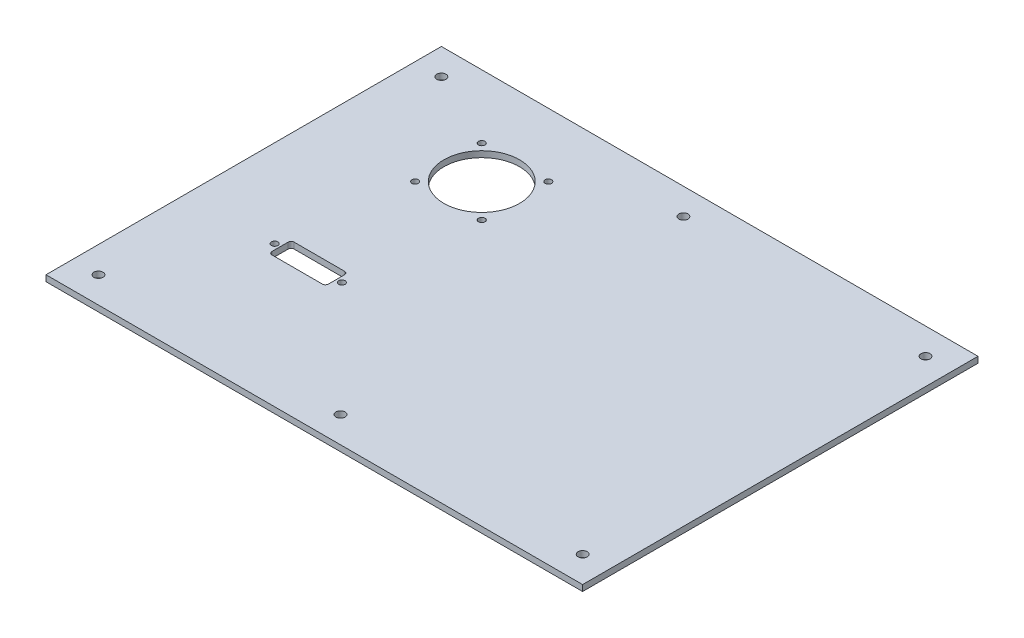
ISO-10303-21;
HEADER;
FILE_DESCRIPTION(('STEP AP214'),'2;1');
FILE_NAME('part.step','',(''),(''),'','','');
FILE_SCHEMA(('AUTOMOTIVE_DESIGN { 1 0 10303 214 1 1 1 1 }'));
ENDSEC;
DATA;
#1=APPLICATION_CONTEXT('core data for automotive mechanical design processes');
#2=APPLICATION_PROTOCOL_DEFINITION('international standard','automotive_design',2000,#1);
#3=PRODUCT_CONTEXT('',#1,'mechanical');
#4=PRODUCT('Part','Part','',(#3));
#5=PRODUCT_RELATED_PRODUCT_CATEGORY('part','',(#4));
#6=PRODUCT_DEFINITION_FORMATION('','',#4);
#7=PRODUCT_DEFINITION_CONTEXT('part definition',#1,'design');
#8=PRODUCT_DEFINITION('design','',#6,#7);
#9=PRODUCT_DEFINITION_SHAPE('','',#8);
#10=(LENGTH_UNIT() NAMED_UNIT(*) SI_UNIT(.MILLI.,.METRE.));
#11=(NAMED_UNIT(*) PLANE_ANGLE_UNIT() SI_UNIT($,.RADIAN.));
#12=(NAMED_UNIT(*) SI_UNIT($,.STERADIAN.) SOLID_ANGLE_UNIT());
#13=UNCERTAINTY_MEASURE_WITH_UNIT(LENGTH_MEASURE(1.E-05),#10,'distance_accuracy_value','');
#14=(GEOMETRIC_REPRESENTATION_CONTEXT(3) GLOBAL_UNCERTAINTY_ASSIGNED_CONTEXT((#13)) GLOBAL_UNIT_ASSIGNED_CONTEXT((#10,
#11,#12)) REPRESENTATION_CONTEXT('',''));
#15=CARTESIAN_POINT('',(0.,0.,0.));
#16=DIRECTION('',(0.,0.,1.));
#17=DIRECTION('',(1.,0.,0.));
#18=AXIS2_PLACEMENT_3D('',#15,#16,#17);
#19=CARTESIAN_POINT('',(0.,3.,0.));
#20=DIRECTION('',(0.,-1.,0.));
#21=DIRECTION('',(0.,0.,-1.));
#22=AXIS2_PLACEMENT_3D('',#19,#20,#21);
#23=PLANE('',#22);
#24=CARTESIAN_POINT('',(76.66,3.,-70.));
#25=DIRECTION('',(0.,1.,0.));
#26=DIRECTION('',(0.,0.,1.));
#27=AXIS2_PLACEMENT_3D('',#24,#25,#26);
#28=CIRCLE('',#27,1.60000000000001);
#29=CARTESIAN_POINT('',(76.66,3.,-68.4));
#30=VERTEX_POINT('',#29);
#31=EDGE_CURVE('E402',#30,#30,#28,.T.);
#32=ORIENTED_EDGE('',*,*,#31,.F.);
#33=EDGE_LOOP('',(#32));
#34=FACE_BOUND('',#33,.T.);
#35=CARTESIAN_POINT('',(43.34,3.,-70.));
#36=DIRECTION('',(0.,1.,0.));
#37=DIRECTION('',(0.,0.,1.));
#38=AXIS2_PLACEMENT_3D('',#35,#36,#37);
#39=CIRCLE('',#38,1.6);
#40=CARTESIAN_POINT('',(43.34,3.,-68.4));
#41=VERTEX_POINT('',#40);
#42=EDGE_CURVE('E404',#41,#41,#39,.T.);
#43=ORIENTED_EDGE('',*,*,#42,.F.);
#44=EDGE_LOOP('',(#43));
#45=FACE_BOUND('',#44,.T.);
#46=DIRECTION('',(0.,0.,1.));
#47=VECTOR('',#46,1.);
#48=CARTESIAN_POINT('',(46.,3.,-75.5));
#49=LINE('',#48,#47);
#50=CARTESIAN_POINT('',(46.,3.,-74.));
#51=VERTEX_POINT('',#50);
#52=CARTESIAN_POINT('',(46.,3.,-66.));
#53=VERTEX_POINT('',#52);
#54=EDGE_CURVE('E191',#51,#53,#49,.T.);
#55=ORIENTED_EDGE('',*,*,#54,.F.);
#56=CARTESIAN_POINT('',(47.5,3.,-74.));
#57=DIRECTION('',(0.,-1.,0.));
#58=DIRECTION('',(0.,0.,-1.));
#59=AXIS2_PLACEMENT_3D('',#56,#57,#58);
#60=CIRCLE('',#59,1.5);
#61=CARTESIAN_POINT('',(47.5,3.,-75.5));
#62=VERTEX_POINT('',#61);
#63=EDGE_CURVE('E44',#51,#62,#60,.T.);
#64=ORIENTED_EDGE('',*,*,#63,.T.);
#65=DIRECTION('',(-1.,0.,0.));
#66=VECTOR('',#65,1.);
#67=CARTESIAN_POINT('',(46.,3.,-75.5));
#68=LINE('',#67,#66);
#69=CARTESIAN_POINT('',(72.5,3.,-75.5));
#70=VERTEX_POINT('',#69);
#71=EDGE_CURVE('E190',#70,#62,#68,.T.);
#72=ORIENTED_EDGE('',*,*,#71,.F.);
#73=CARTESIAN_POINT('',(72.5,3.,-74.));
#74=DIRECTION('',(0.,-1.,0.));
#75=DIRECTION('',(0.,0.,-1.));
#76=AXIS2_PLACEMENT_3D('',#73,#74,#75);
#77=CIRCLE('',#76,1.5);
#78=CARTESIAN_POINT('',(74.,3.,-74.));
#79=VERTEX_POINT('',#78);
#80=EDGE_CURVE('E178',#70,#79,#77,.T.);
#81=ORIENTED_EDGE('',*,*,#80,.T.);
#82=DIRECTION('',(0.,0.,-1.));
#83=VECTOR('',#82,1.);
#84=CARTESIAN_POINT('',(74.,3.,-75.5));
#85=LINE('',#84,#83);
#86=CARTESIAN_POINT('',(74.,3.,-66.));
#87=VERTEX_POINT('',#86);
#88=EDGE_CURVE('E210',#87,#79,#85,.T.);
#89=ORIENTED_EDGE('',*,*,#88,.F.);
#90=CARTESIAN_POINT('',(72.5,3.,-66.));
#91=DIRECTION('',(0.,-1.,0.));
#92=DIRECTION('',(0.,0.,-1.));
#93=AXIS2_PLACEMENT_3D('',#90,#91,#92);
#94=CIRCLE('',#93,1.5);
#95=CARTESIAN_POINT('',(72.5,3.,-64.5));
#96=VERTEX_POINT('',#95);
#97=EDGE_CURVE('E174',#87,#96,#94,.T.);
#98=ORIENTED_EDGE('',*,*,#97,.T.);
#99=DIRECTION('',(1.,0.,0.));
#100=VECTOR('',#99,1.);
#101=CARTESIAN_POINT('',(46.,3.,-64.5));
#102=LINE('',#101,#100);
#103=CARTESIAN_POINT('',(47.5,3.,-64.5));
#104=VERTEX_POINT('',#103);
#105=EDGE_CURVE('E218',#104,#96,#102,.T.);
#106=ORIENTED_EDGE('',*,*,#105,.F.);
#107=CARTESIAN_POINT('',(47.5,3.,-66.));
#108=DIRECTION('',(0.,-1.,0.));
#109=DIRECTION('',(0.,0.,-1.));
#110=AXIS2_PLACEMENT_3D('',#107,#108,#109);
#111=CIRCLE('',#110,1.5);
#112=EDGE_CURVE('E182',#104,#53,#111,.T.);
#113=ORIENTED_EDGE('',*,*,#112,.T.);
#114=EDGE_LOOP('',(#55,#64,#72,#81,#89,#98,#106,#113));
#115=FACE_BOUND('',#114,.T.);
#116=CARTESIAN_POINT('',(51.4999999999993,3.,-164.5));
#117=DIRECTION('',(0.,1.,0.));
#118=DIRECTION('',(0.,0.,1.));
#119=AXIS2_PLACEMENT_3D('',#116,#117,#118);
#120=CIRCLE('',#119,1.6);
#121=CARTESIAN_POINT('',(51.4999999999993,3.,-162.9));
#122=VERTEX_POINT('',#121);
#123=EDGE_CURVE('E215',#122,#122,#120,.T.);
#124=ORIENTED_EDGE('',*,*,#123,.F.);
#125=EDGE_LOOP('',(#124));
#126=FACE_BOUND('',#125,.T.);
#127=CARTESIAN_POINT('',(51.4999999999993,3.,-131.5));
#128=DIRECTION('',(0.,1.,0.));
#129=DIRECTION('',(0.,0.,1.));
#130=AXIS2_PLACEMENT_3D('',#127,#128,#129);
#131=CIRCLE('',#130,1.6);
#132=CARTESIAN_POINT('',(51.4999999999993,3.,-129.9));
#133=VERTEX_POINT('',#132);
#134=EDGE_CURVE('E226',#133,#133,#131,.T.);
#135=ORIENTED_EDGE('',*,*,#134,.F.);
#136=EDGE_LOOP('',(#135));
#137=FACE_BOUND('',#136,.T.);
#138=CARTESIAN_POINT('',(84.4999999999993,3.,-131.5));
#139=DIRECTION('',(0.,1.,0.));
#140=DIRECTION('',(0.,0.,1.));
#141=AXIS2_PLACEMENT_3D('',#138,#139,#140);
#142=CIRCLE('',#141,1.6);
#143=CARTESIAN_POINT('',(84.4999999999993,3.,-129.9));
#144=VERTEX_POINT('',#143);
#145=EDGE_CURVE('E232',#144,#144,#142,.T.);
#146=ORIENTED_EDGE('',*,*,#145,.F.);
#147=EDGE_LOOP('',(#146));
#148=FACE_BOUND('',#147,.T.);
#149=CARTESIAN_POINT('',(84.4999999999993,3.,-164.5));
#150=DIRECTION('',(0.,1.,0.));
#151=DIRECTION('',(0.,0.,1.));
#152=AXIS2_PLACEMENT_3D('',#149,#150,#151);
#153=CIRCLE('',#152,1.6);
#154=CARTESIAN_POINT('',(84.4999999999993,3.,-162.9));
#155=VERTEX_POINT('',#154);
#156=EDGE_CURVE('E238',#155,#155,#153,.T.);
#157=ORIENTED_EDGE('',*,*,#156,.F.);
#158=EDGE_LOOP('',(#157));
#159=FACE_BOUND('',#158,.T.);
#160=CARTESIAN_POINT('',(67.9999999999993,3.,-148.));
#161=DIRECTION('',(0.,1.,0.));
#162=DIRECTION('',(0.,0.,1.));
#163=AXIS2_PLACEMENT_3D('',#160,#161,#162);
#164=CIRCLE('',#163,18.75);
#165=CARTESIAN_POINT('',(67.9999999999993,3.,-129.25));
#166=VERTEX_POINT('',#165);
#167=EDGE_CURVE('E244',#166,#166,#164,.T.);
#168=ORIENTED_EDGE('',*,*,#167,.F.);
#169=EDGE_LOOP('',(#168));
#170=FACE_BOUND('',#169,.T.);
#171=DIRECTION('',(0.,0.,1.));
#172=VECTOR('',#171,1.);
#173=CARTESIAN_POINT('',(0.,3.,0.));
#174=LINE('',#173,#172);
#175=CARTESIAN_POINT('',(0.,3.,-196.));
#176=VERTEX_POINT('',#175);
#177=CARTESIAN_POINT('',(0.,3.,0.));
#178=VERTEX_POINT('',#177);
#179=EDGE_CURVE('E136',#176,#178,#174,.T.);
#180=ORIENTED_EDGE('',*,*,#179,.T.);
#181=DIRECTION('',(1.,0.,0.));
#182=VECTOR('',#181,1.);
#183=CARTESIAN_POINT('',(0.,3.,0.));
#184=LINE('',#183,#182);
#185=CARTESIAN_POINT('',(266.,3.,0.));
#186=VERTEX_POINT('',#185);
#187=EDGE_CURVE('E125',#178,#186,#184,.T.);
#188=ORIENTED_EDGE('',*,*,#187,.T.);
#189=DIRECTION('',(0.,0.,-1.));
#190=VECTOR('',#189,1.);
#191=CARTESIAN_POINT('',(266.,3.,0.));
#192=LINE('',#191,#190);
#193=CARTESIAN_POINT('',(266.,3.,-196.));
#194=VERTEX_POINT('',#193);
#195=EDGE_CURVE('E135',#186,#194,#192,.T.);
#196=ORIENTED_EDGE('',*,*,#195,.T.);
#197=DIRECTION('',(-1.,0.,0.));
#198=VECTOR('',#197,1.);
#199=CARTESIAN_POINT('',(0.,3.,-196.));
#200=LINE('',#199,#198);
#201=EDGE_CURVE('E141',#194,#176,#200,.T.);
#202=ORIENTED_EDGE('',*,*,#201,.T.);
#203=EDGE_LOOP('',(#180,#188,#196,#202));
#204=FACE_BOUND('',#203,.T.);
#205=CARTESIAN_POINT('',(13.,3.,-183.));
#206=DIRECTION('',(0.,1.,0.));
#207=DIRECTION('',(0.,0.,1.));
#208=AXIS2_PLACEMENT_3D('',#205,#206,#207);
#209=CIRCLE('',#208,2.25);
#210=CARTESIAN_POINT('',(13.,3.,-180.75));
#211=VERTEX_POINT('',#210);
#212=EDGE_CURVE('E283',#211,#211,#209,.T.);
#213=ORIENTED_EDGE('',*,*,#212,.F.);
#214=EDGE_LOOP('',(#213));
#215=FACE_BOUND('',#214,.T.);
#216=CARTESIAN_POINT('',(253.,3.,-183.));
#217=DIRECTION('',(0.,1.,0.));
#218=DIRECTION('',(0.,0.,1.));
#219=AXIS2_PLACEMENT_3D('',#216,#217,#218);
#220=CIRCLE('',#219,2.24999999999996);
#221=CARTESIAN_POINT('',(253.,3.,-180.75));
#222=VERTEX_POINT('',#221);
#223=EDGE_CURVE('E277',#222,#222,#220,.T.);
#224=ORIENTED_EDGE('',*,*,#223,.F.);
#225=EDGE_LOOP('',(#224));
#226=FACE_BOUND('',#225,.T.);
#227=CARTESIAN_POINT('',(253.,3.,-13.));
#228=DIRECTION('',(0.,1.,0.));
#229=DIRECTION('',(0.,0.,1.));
#230=AXIS2_PLACEMENT_3D('',#227,#228,#229);
#231=CIRCLE('',#230,2.24999999999995);
#232=CARTESIAN_POINT('',(253.,3.,-10.7500000000001));
#233=VERTEX_POINT('',#232);
#234=EDGE_CURVE('E271',#233,#233,#231,.T.);
#235=ORIENTED_EDGE('',*,*,#234,.F.);
#236=EDGE_LOOP('',(#235));
#237=FACE_BOUND('',#236,.T.);
#238=CARTESIAN_POINT('',(13.,3.,-13.));
#239=DIRECTION('',(0.,1.,0.));
#240=DIRECTION('',(0.,0.,1.));
#241=AXIS2_PLACEMENT_3D('',#238,#239,#240);
#242=CIRCLE('',#241,2.25);
#243=CARTESIAN_POINT('',(13.,3.,-10.75));
#244=VERTEX_POINT('',#243);
#245=EDGE_CURVE('E265',#244,#244,#242,.T.);
#246=ORIENTED_EDGE('',*,*,#245,.F.);
#247=EDGE_LOOP('',(#246));
#248=FACE_BOUND('',#247,.T.);
#249=CARTESIAN_POINT('',(133.,3.,-13.));
#250=DIRECTION('',(0.,1.,0.));
#251=DIRECTION('',(0.,0.,1.));
#252=AXIS2_PLACEMENT_3D('',#249,#250,#251);
#253=CIRCLE('',#252,2.25000000000004);
#254=CARTESIAN_POINT('',(133.,3.,-10.75));
#255=VERTEX_POINT('',#254);
#256=EDGE_CURVE('E259',#255,#255,#253,.T.);
#257=ORIENTED_EDGE('',*,*,#256,.F.);
#258=EDGE_LOOP('',(#257));
#259=FACE_BOUND('',#258,.T.);
#260=CARTESIAN_POINT('',(133.,3.,-183.));
#261=DIRECTION('',(0.,1.,0.));
#262=DIRECTION('',(0.,0.,1.));
#263=AXIS2_PLACEMENT_3D('',#260,#261,#262);
#264=CIRCLE('',#263,2.25000000000001);
#265=CARTESIAN_POINT('',(133.,3.,-180.75));
#266=VERTEX_POINT('',#265);
#267=EDGE_CURVE('E253',#266,#266,#264,.T.);
#268=ORIENTED_EDGE('',*,*,#267,.F.);
#269=EDGE_LOOP('',(#268));
#270=FACE_BOUND('',#269,.T.);
#271=ADVANCED_FACE('F36',(#34,#45,#115,#126,#137,#148,#159,#170,#204,#215,#226,#237,#248,#259,
#270),#23,.F.);
#272=CARTESIAN_POINT('',(0.,0.,0.));
#273=DIRECTION('',(0.,-1.,0.));
#274=DIRECTION('',(0.,0.,-1.));
#275=AXIS2_PLACEMENT_3D('',#272,#273,#274);
#276=PLANE('',#275);
#277=CARTESIAN_POINT('',(76.66,0.,-70.));
#278=DIRECTION('',(0.,1.,0.));
#279=DIRECTION('',(0.,0.,1.));
#280=AXIS2_PLACEMENT_3D('',#277,#278,#279);
#281=CIRCLE('',#280,1.60000000000001);
#282=CARTESIAN_POINT('',(76.66,0.,-68.4));
#283=VERTEX_POINT('',#282);
#284=EDGE_CURVE('E400',#283,#283,#281,.T.);
#285=ORIENTED_EDGE('',*,*,#284,.T.);
#286=EDGE_LOOP('',(#285));
#287=FACE_BOUND('',#286,.T.);
#288=CARTESIAN_POINT('',(43.34,0.,-70.));
#289=DIRECTION('',(0.,1.,0.));
#290=DIRECTION('',(0.,0.,1.));
#291=AXIS2_PLACEMENT_3D('',#288,#289,#290);
#292=CIRCLE('',#291,1.6);
#293=CARTESIAN_POINT('',(43.34,0.,-68.4));
#294=VERTEX_POINT('',#293);
#295=EDGE_CURVE('E199',#294,#294,#292,.T.);
#296=ORIENTED_EDGE('',*,*,#295,.T.);
#297=EDGE_LOOP('',(#296));
#298=FACE_BOUND('',#297,.T.);
#299=DIRECTION('',(0.,0.,-1.));
#300=VECTOR('',#299,1.);
#301=CARTESIAN_POINT('',(74.,0.,-75.5));
#302=LINE('',#301,#300);
#303=CARTESIAN_POINT('',(74.,0.,-66.));
#304=VERTEX_POINT('',#303);
#305=CARTESIAN_POINT('',(74.,0.,-74.));
#306=VERTEX_POINT('',#305);
#307=EDGE_CURVE('E208',#304,#306,#302,.T.);
#308=ORIENTED_EDGE('',*,*,#307,.T.);
#309=CARTESIAN_POINT('',(72.5,0.,-74.));
#310=DIRECTION('',(0.,-1.,0.));
#311=DIRECTION('',(0.,0.,-1.));
#312=AXIS2_PLACEMENT_3D('',#309,#310,#311);
#313=CIRCLE('',#312,1.5);
#314=CARTESIAN_POINT('',(72.5,0.,-75.5));
#315=VERTEX_POINT('',#314);
#316=EDGE_CURVE('E180',#306,#315,#313,.F.);
#317=ORIENTED_EDGE('',*,*,#316,.T.);
#318=DIRECTION('',(-1.,0.,0.));
#319=VECTOR('',#318,1.);
#320=CARTESIAN_POINT('',(46.,0.,-75.5));
#321=LINE('',#320,#319);
#322=CARTESIAN_POINT('',(47.5,0.,-75.5));
#323=VERTEX_POINT('',#322);
#324=EDGE_CURVE('E205',#315,#323,#321,.T.);
#325=ORIENTED_EDGE('',*,*,#324,.T.);
#326=CARTESIAN_POINT('',(47.5,0.,-74.));
#327=DIRECTION('',(0.,-1.,0.));
#328=DIRECTION('',(0.,0.,-1.));
#329=AXIS2_PLACEMENT_3D('',#326,#327,#328);
#330=CIRCLE('',#329,1.5);
#331=CARTESIAN_POINT('',(46.,0.,-74.));
#332=VERTEX_POINT('',#331);
#333=EDGE_CURVE('E11',#323,#332,#330,.F.);
#334=ORIENTED_EDGE('',*,*,#333,.T.);
#335=DIRECTION('',(0.,0.,1.));
#336=VECTOR('',#335,1.);
#337=CARTESIAN_POINT('',(46.,0.,-75.5));
#338=LINE('',#337,#336);
#339=CARTESIAN_POINT('',(46.,0.,-66.));
#340=VERTEX_POINT('',#339);
#341=EDGE_CURVE('E202',#332,#340,#338,.T.);
#342=ORIENTED_EDGE('',*,*,#341,.T.);
#343=CARTESIAN_POINT('',(47.5,0.,-66.));
#344=DIRECTION('',(0.,-1.,0.));
#345=DIRECTION('',(0.,0.,-1.));
#346=AXIS2_PLACEMENT_3D('',#343,#344,#345);
#347=CIRCLE('',#346,1.5);
#348=CARTESIAN_POINT('',(47.5,0.,-64.5));
#349=VERTEX_POINT('',#348);
#350=EDGE_CURVE('E184',#340,#349,#347,.F.);
#351=ORIENTED_EDGE('',*,*,#350,.T.);
#352=DIRECTION('',(1.,0.,0.));
#353=VECTOR('',#352,1.);
#354=CARTESIAN_POINT('',(46.,0.,-64.5));
#355=LINE('',#354,#353);
#356=CARTESIAN_POINT('',(72.5,0.,-64.5));
#357=VERTEX_POINT('',#356);
#358=EDGE_CURVE('E204',#349,#357,#355,.T.);
#359=ORIENTED_EDGE('',*,*,#358,.T.);
#360=CARTESIAN_POINT('',(72.5,0.,-66.));
#361=DIRECTION('',(0.,-1.,0.));
#362=DIRECTION('',(0.,0.,-1.));
#363=AXIS2_PLACEMENT_3D('',#360,#361,#362);
#364=CIRCLE('',#363,1.5);
#365=EDGE_CURVE('E176',#357,#304,#364,.F.);
#366=ORIENTED_EDGE('',*,*,#365,.T.);
#367=EDGE_LOOP('',(#308,#317,#325,#334,#342,#351,#359,#366));
#368=FACE_BOUND('',#367,.T.);
#369=CARTESIAN_POINT('',(51.4999999999993,0.,-164.5));
#370=DIRECTION('',(0.,1.,0.));
#371=DIRECTION('',(0.,0.,1.));
#372=AXIS2_PLACEMENT_3D('',#369,#370,#371);
#373=CIRCLE('',#372,1.6);
#374=CARTESIAN_POINT('',(51.4999999999993,0.,-162.9));
#375=VERTEX_POINT('',#374);
#376=EDGE_CURVE('E223',#375,#375,#373,.T.);
#377=ORIENTED_EDGE('',*,*,#376,.T.);
#378=EDGE_LOOP('',(#377));
#379=FACE_BOUND('',#378,.T.);
#380=CARTESIAN_POINT('',(51.4999999999993,0.,-131.5));
#381=DIRECTION('',(0.,1.,0.));
#382=DIRECTION('',(0.,0.,1.));
#383=AXIS2_PLACEMENT_3D('',#380,#381,#382);
#384=CIRCLE('',#383,1.6);
#385=CARTESIAN_POINT('',(51.4999999999993,0.,-129.9));
#386=VERTEX_POINT('',#385);
#387=EDGE_CURVE('E229',#386,#386,#384,.T.);
#388=ORIENTED_EDGE('',*,*,#387,.T.);
#389=EDGE_LOOP('',(#388));
#390=FACE_BOUND('',#389,.T.);
#391=CARTESIAN_POINT('',(84.4999999999993,0.,-131.5));
#392=DIRECTION('',(0.,1.,0.));
#393=DIRECTION('',(0.,0.,1.));
#394=AXIS2_PLACEMENT_3D('',#391,#392,#393);
#395=CIRCLE('',#394,1.6);
#396=CARTESIAN_POINT('',(84.4999999999993,0.,-129.9));
#397=VERTEX_POINT('',#396);
#398=EDGE_CURVE('E235',#397,#397,#395,.T.);
#399=ORIENTED_EDGE('',*,*,#398,.T.);
#400=EDGE_LOOP('',(#399));
#401=FACE_BOUND('',#400,.T.);
#402=CARTESIAN_POINT('',(84.4999999999993,0.,-164.5));
#403=DIRECTION('',(0.,1.,0.));
#404=DIRECTION('',(0.,0.,1.));
#405=AXIS2_PLACEMENT_3D('',#402,#403,#404);
#406=CIRCLE('',#405,1.6);
#407=CARTESIAN_POINT('',(84.4999999999993,0.,-162.9));
#408=VERTEX_POINT('',#407);
#409=EDGE_CURVE('E241',#408,#408,#406,.T.);
#410=ORIENTED_EDGE('',*,*,#409,.T.);
#411=EDGE_LOOP('',(#410));
#412=FACE_BOUND('',#411,.T.);
#413=CARTESIAN_POINT('',(67.9999999999993,0.,-148.));
#414=DIRECTION('',(0.,1.,0.));
#415=DIRECTION('',(0.,0.,1.));
#416=AXIS2_PLACEMENT_3D('',#413,#414,#415);
#417=CIRCLE('',#416,18.75);
#418=CARTESIAN_POINT('',(67.9999999999993,0.,-129.25));
#419=VERTEX_POINT('',#418);
#420=EDGE_CURVE('E247',#419,#419,#417,.T.);
#421=ORIENTED_EDGE('',*,*,#420,.T.);
#422=EDGE_LOOP('',(#421));
#423=FACE_BOUND('',#422,.T.);
#424=CARTESIAN_POINT('',(133.,0.,-13.));
#425=DIRECTION('',(0.,1.,0.));
#426=DIRECTION('',(0.,0.,1.));
#427=AXIS2_PLACEMENT_3D('',#424,#425,#426);
#428=CIRCLE('',#427,2.25000000000004);
#429=CARTESIAN_POINT('',(133.,0.,-10.75));
#430=VERTEX_POINT('',#429);
#431=EDGE_CURVE('E256',#430,#430,#428,.T.);
#432=ORIENTED_EDGE('',*,*,#431,.T.);
#433=EDGE_LOOP('',(#432));
#434=FACE_BOUND('',#433,.T.);
#435=CARTESIAN_POINT('',(253.,0.,-13.));
#436=DIRECTION('',(0.,1.,0.));
#437=DIRECTION('',(0.,0.,1.));
#438=AXIS2_PLACEMENT_3D('',#435,#436,#437);
#439=CIRCLE('',#438,2.24999999999995);
#440=CARTESIAN_POINT('',(253.,0.,-10.7500000000001));
#441=VERTEX_POINT('',#440);
#442=EDGE_CURVE('E268',#441,#441,#439,.T.);
#443=ORIENTED_EDGE('',*,*,#442,.T.);
#444=EDGE_LOOP('',(#443));
#445=FACE_BOUND('',#444,.T.);
#446=CARTESIAN_POINT('',(13.,0.,-183.));
#447=DIRECTION('',(0.,1.,0.));
#448=DIRECTION('',(0.,0.,1.));
#449=AXIS2_PLACEMENT_3D('',#446,#447,#448);
#450=CIRCLE('',#449,2.25);
#451=CARTESIAN_POINT('',(13.,0.,-180.75));
#452=VERTEX_POINT('',#451);
#453=EDGE_CURVE('E280',#452,#452,#450,.T.);
#454=ORIENTED_EDGE('',*,*,#453,.T.);
#455=EDGE_LOOP('',(#454));
#456=FACE_BOUND('',#455,.T.);
#457=DIRECTION('',(0.,0.,1.));
#458=VECTOR('',#457,1.);
#459=CARTESIAN_POINT('',(0.,0.,0.));
#460=LINE('',#459,#458);
#461=CARTESIAN_POINT('',(0.,0.,-196.));
#462=VERTEX_POINT('',#461);
#463=CARTESIAN_POINT('',(0.,0.,0.));
#464=VERTEX_POINT('',#463);
#465=EDGE_CURVE('E149',#462,#464,#460,.T.);
#466=ORIENTED_EDGE('',*,*,#465,.F.);
#467=DIRECTION('',(-1.,0.,0.));
#468=VECTOR('',#467,1.);
#469=CARTESIAN_POINT('',(0.,0.,-196.));
#470=LINE('',#469,#468);
#471=CARTESIAN_POINT('',(266.,0.,-196.));
#472=VERTEX_POINT('',#471);
#473=EDGE_CURVE('E145',#472,#462,#470,.T.);
#474=ORIENTED_EDGE('',*,*,#473,.F.);
#475=DIRECTION('',(0.,0.,-1.));
#476=VECTOR('',#475,1.);
#477=CARTESIAN_POINT('',(266.,0.,0.));
#478=LINE('',#477,#476);
#479=CARTESIAN_POINT('',(266.,0.,0.));
#480=VERTEX_POINT('',#479);
#481=EDGE_CURVE('E294',#480,#472,#478,.T.);
#482=ORIENTED_EDGE('',*,*,#481,.F.);
#483=DIRECTION('',(1.,0.,0.));
#484=VECTOR('',#483,1.);
#485=CARTESIAN_POINT('',(0.,0.,0.));
#486=LINE('',#485,#484);
#487=EDGE_CURVE('E292',#464,#480,#486,.T.);
#488=ORIENTED_EDGE('',*,*,#487,.F.);
#489=EDGE_LOOP('',(#466,#474,#482,#488));
#490=FACE_BOUND('',#489,.T.);
#491=CARTESIAN_POINT('',(253.,0.,-183.));
#492=DIRECTION('',(0.,1.,0.));
#493=DIRECTION('',(0.,0.,1.));
#494=AXIS2_PLACEMENT_3D('',#491,#492,#493);
#495=CIRCLE('',#494,2.24999999999996);
#496=CARTESIAN_POINT('',(253.,0.,-180.75));
#497=VERTEX_POINT('',#496);
#498=EDGE_CURVE('E274',#497,#497,#495,.T.);
#499=ORIENTED_EDGE('',*,*,#498,.T.);
#500=EDGE_LOOP('',(#499));
#501=FACE_BOUND('',#500,.T.);
#502=CARTESIAN_POINT('',(13.,0.,-13.));
#503=DIRECTION('',(0.,1.,0.));
#504=DIRECTION('',(0.,0.,1.));
#505=AXIS2_PLACEMENT_3D('',#502,#503,#504);
#506=CIRCLE('',#505,2.25);
#507=CARTESIAN_POINT('',(13.,0.,-10.75));
#508=VERTEX_POINT('',#507);
#509=EDGE_CURVE('E262',#508,#508,#506,.T.);
#510=ORIENTED_EDGE('',*,*,#509,.T.);
#511=EDGE_LOOP('',(#510));
#512=FACE_BOUND('',#511,.T.);
#513=CARTESIAN_POINT('',(133.,0.,-183.));
#514=DIRECTION('',(0.,1.,0.));
#515=DIRECTION('',(0.,0.,1.));
#516=AXIS2_PLACEMENT_3D('',#513,#514,#515);
#517=CIRCLE('',#516,2.25000000000001);
#518=CARTESIAN_POINT('',(133.,0.,-180.75));
#519=VERTEX_POINT('',#518);
#520=EDGE_CURVE('E250',#519,#519,#517,.T.);
#521=ORIENTED_EDGE('',*,*,#520,.T.);
#522=EDGE_LOOP('',(#521));
#523=FACE_BOUND('',#522,.T.);
#524=ADVANCED_FACE('F305',(#287,#298,#368,#379,#390,#401,#412,#423,#434,#445,#456,#490,#501,
#512,#523),#276,.T.);
#525=CARTESIAN_POINT('',(0.,3.,0.));
#526=DIRECTION('',(1.,0.,0.));
#527=DIRECTION('',(0.,0.,-1.));
#528=AXIS2_PLACEMENT_3D('',#525,#526,#527);
#529=PLANE('',#528);
#530=ORIENTED_EDGE('',*,*,#465,.T.);
#531=DIRECTION('',(0.,-1.,0.));
#532=VECTOR('',#531,1.);
#533=CARTESIAN_POINT('',(0.,3.,0.));
#534=LINE('',#533,#532);
#535=EDGE_CURVE('E129',#178,#464,#534,.T.);
#536=ORIENTED_EDGE('',*,*,#535,.F.);
#537=ORIENTED_EDGE('',*,*,#179,.F.);
#538=DIRECTION('',(0.,-1.,0.));
#539=VECTOR('',#538,1.);
#540=CARTESIAN_POINT('',(0.,3.,-196.));
#541=LINE('',#540,#539);
#542=EDGE_CURVE('E290',#176,#462,#541,.T.);
#543=ORIENTED_EDGE('',*,*,#542,.T.);
#544=EDGE_LOOP('',(#530,#536,#537,#543));
#545=FACE_BOUND('',#544,.T.);
#546=ADVANCED_FACE('F147',(#545),#529,.F.);
#547=CARTESIAN_POINT('',(0.,3.,0.));
#548=DIRECTION('',(0.,0.,-1.));
#549=DIRECTION('',(-1.,0.,0.));
#550=AXIS2_PLACEMENT_3D('',#547,#548,#549);
#551=PLANE('',#550);
#552=ORIENTED_EDGE('',*,*,#487,.T.);
#553=DIRECTION('',(0.,-1.,0.));
#554=VECTOR('',#553,1.);
#555=CARTESIAN_POINT('',(266.,3.,0.));
#556=LINE('',#555,#554);
#557=EDGE_CURVE('E132',#186,#480,#556,.T.);
#558=ORIENTED_EDGE('',*,*,#557,.F.);
#559=ORIENTED_EDGE('',*,*,#187,.F.);
#560=ORIENTED_EDGE('',*,*,#535,.T.);
#561=EDGE_LOOP('',(#552,#558,#559,#560));
#562=FACE_BOUND('',#561,.T.);
#563=ADVANCED_FACE('F127',(#562),#551,.F.);
#564=CARTESIAN_POINT('',(266.,3.,0.));
#565=DIRECTION('',(-1.,0.,0.));
#566=DIRECTION('',(0.,0.,1.));
#567=AXIS2_PLACEMENT_3D('',#564,#565,#566);
#568=PLANE('',#567);
#569=ORIENTED_EDGE('',*,*,#481,.T.);
#570=DIRECTION('',(0.,-1.,0.));
#571=VECTOR('',#570,1.);
#572=CARTESIAN_POINT('',(266.,3.,-196.));
#573=LINE('',#572,#571);
#574=EDGE_CURVE('E154',#194,#472,#573,.T.);
#575=ORIENTED_EDGE('',*,*,#574,.F.);
#576=ORIENTED_EDGE('',*,*,#195,.F.);
#577=ORIENTED_EDGE('',*,*,#557,.T.);
#578=EDGE_LOOP('',(#569,#575,#576,#577));
#579=FACE_BOUND('',#578,.T.);
#580=ADVANCED_FACE('F307',(#579),#568,.F.);
#581=CARTESIAN_POINT('',(0.,3.,-196.));
#582=DIRECTION('',(0.,0.,1.));
#583=DIRECTION('',(1.,0.,0.));
#584=AXIS2_PLACEMENT_3D('',#581,#582,#583);
#585=PLANE('',#584);
#586=ORIENTED_EDGE('',*,*,#473,.T.);
#587=ORIENTED_EDGE('',*,*,#542,.F.);
#588=ORIENTED_EDGE('',*,*,#201,.F.);
#589=ORIENTED_EDGE('',*,*,#574,.T.);
#590=EDGE_LOOP('',(#586,#587,#588,#589));
#591=FACE_BOUND('',#590,.T.);
#592=ADVANCED_FACE('F301',(#591),#585,.F.);
#593=CARTESIAN_POINT('',(13.,3.,-183.));
#594=DIRECTION('',(0.,-1.,0.));
#595=DIRECTION('',(0.,0.,-1.));
#596=AXIS2_PLACEMENT_3D('',#593,#594,#595);
#597=CYLINDRICAL_SURFACE('',#596,2.25);
#598=ORIENTED_EDGE('',*,*,#212,.T.);
#599=EDGE_LOOP('',(#598));
#600=FACE_BOUND('',#599,.T.);
#601=ORIENTED_EDGE('',*,*,#453,.F.);
#602=EDGE_LOOP('',(#601));
#603=FACE_BOUND('',#602,.T.);
#604=ADVANCED_FACE('F314',(#600,#603),#597,.F.);
#605=CARTESIAN_POINT('',(253.,3.,-183.));
#606=DIRECTION('',(0.,-1.,0.));
#607=DIRECTION('',(0.,0.,-1.));
#608=AXIS2_PLACEMENT_3D('',#605,#606,#607);
#609=CYLINDRICAL_SURFACE('',#608,2.24999999999996);
#610=ORIENTED_EDGE('',*,*,#223,.T.);
#611=EDGE_LOOP('',(#610));
#612=FACE_BOUND('',#611,.T.);
#613=ORIENTED_EDGE('',*,*,#498,.F.);
#614=EDGE_LOOP('',(#613));
#615=FACE_BOUND('',#614,.T.);
#616=ADVANCED_FACE('F330',(#612,#615),#609,.F.);
#617=CARTESIAN_POINT('',(253.,3.,-13.));
#618=DIRECTION('',(0.,-1.,0.));
#619=DIRECTION('',(0.,0.,-1.));
#620=AXIS2_PLACEMENT_3D('',#617,#618,#619);
#621=CYLINDRICAL_SURFACE('',#620,2.24999999999995);
#622=ORIENTED_EDGE('',*,*,#234,.T.);
#623=EDGE_LOOP('',(#622));
#624=FACE_BOUND('',#623,.T.);
#625=ORIENTED_EDGE('',*,*,#442,.F.);
#626=EDGE_LOOP('',(#625));
#627=FACE_BOUND('',#626,.T.);
#628=ADVANCED_FACE('F334',(#624,#627),#621,.F.);
#629=CARTESIAN_POINT('',(13.,3.,-13.));
#630=DIRECTION('',(0.,-1.,0.));
#631=DIRECTION('',(0.,0.,-1.));
#632=AXIS2_PLACEMENT_3D('',#629,#630,#631);
#633=CYLINDRICAL_SURFACE('',#632,2.25);
#634=ORIENTED_EDGE('',*,*,#245,.T.);
#635=EDGE_LOOP('',(#634));
#636=FACE_BOUND('',#635,.T.);
#637=ORIENTED_EDGE('',*,*,#509,.F.);
#638=EDGE_LOOP('',(#637));
#639=FACE_BOUND('',#638,.T.);
#640=ADVANCED_FACE('F338',(#636,#639),#633,.F.);
#641=CARTESIAN_POINT('',(133.,3.,-13.));
#642=DIRECTION('',(0.,-1.,0.));
#643=DIRECTION('',(0.,0.,-1.));
#644=AXIS2_PLACEMENT_3D('',#641,#642,#643);
#645=CYLINDRICAL_SURFACE('',#644,2.25000000000004);
#646=ORIENTED_EDGE('',*,*,#256,.T.);
#647=EDGE_LOOP('',(#646));
#648=FACE_BOUND('',#647,.T.);
#649=ORIENTED_EDGE('',*,*,#431,.F.);
#650=EDGE_LOOP('',(#649));
#651=FACE_BOUND('',#650,.T.);
#652=ADVANCED_FACE('F342',(#648,#651),#645,.F.);
#653=CARTESIAN_POINT('',(133.,3.,-183.));
#654=DIRECTION('',(0.,-1.,0.));
#655=DIRECTION('',(0.,0.,-1.));
#656=AXIS2_PLACEMENT_3D('',#653,#654,#655);
#657=CYLINDRICAL_SURFACE('',#656,2.25000000000001);
#658=ORIENTED_EDGE('',*,*,#267,.T.);
#659=EDGE_LOOP('',(#658));
#660=FACE_BOUND('',#659,.T.);
#661=ORIENTED_EDGE('',*,*,#520,.F.);
#662=EDGE_LOOP('',(#661));
#663=FACE_BOUND('',#662,.T.);
#664=ADVANCED_FACE('F346',(#660,#663),#657,.F.);
#665=CARTESIAN_POINT('',(67.9999999999993,0.,-148.));
#666=DIRECTION('',(0.,1.,0.));
#667=DIRECTION('',(0.,0.,1.));
#668=AXIS2_PLACEMENT_3D('',#665,#666,#667);
#669=CYLINDRICAL_SURFACE('',#668,18.75);
#670=ORIENTED_EDGE('',*,*,#420,.F.);
#671=EDGE_LOOP('',(#670));
#672=FACE_BOUND('',#671,.T.);
#673=ORIENTED_EDGE('',*,*,#167,.T.);
#674=EDGE_LOOP('',(#673));
#675=FACE_BOUND('',#674,.T.);
#676=ADVANCED_FACE('F350',(#672,#675),#669,.F.);
#677=CARTESIAN_POINT('',(84.4999999999993,0.,-164.5));
#678=DIRECTION('',(0.,1.,0.));
#679=DIRECTION('',(0.,0.,1.));
#680=AXIS2_PLACEMENT_3D('',#677,#678,#679);
#681=CYLINDRICAL_SURFACE('',#680,1.6);
#682=ORIENTED_EDGE('',*,*,#409,.F.);
#683=EDGE_LOOP('',(#682));
#684=FACE_BOUND('',#683,.T.);
#685=ORIENTED_EDGE('',*,*,#156,.T.);
#686=EDGE_LOOP('',(#685));
#687=FACE_BOUND('',#686,.T.);
#688=ADVANCED_FACE('F354',(#684,#687),#681,.F.);
#689=CARTESIAN_POINT('',(84.4999999999993,0.,-131.5));
#690=DIRECTION('',(0.,1.,0.));
#691=DIRECTION('',(0.,0.,1.));
#692=AXIS2_PLACEMENT_3D('',#689,#690,#691);
#693=CYLINDRICAL_SURFACE('',#692,1.6);
#694=ORIENTED_EDGE('',*,*,#398,.F.);
#695=EDGE_LOOP('',(#694));
#696=FACE_BOUND('',#695,.T.);
#697=ORIENTED_EDGE('',*,*,#145,.T.);
#698=EDGE_LOOP('',(#697));
#699=FACE_BOUND('',#698,.T.);
#700=ADVANCED_FACE('F358',(#696,#699),#693,.F.);
#701=CARTESIAN_POINT('',(51.4999999999993,0.,-131.5));
#702=DIRECTION('',(0.,1.,0.));
#703=DIRECTION('',(0.,0.,1.));
#704=AXIS2_PLACEMENT_3D('',#701,#702,#703);
#705=CYLINDRICAL_SURFACE('',#704,1.6);
#706=ORIENTED_EDGE('',*,*,#387,.F.);
#707=EDGE_LOOP('',(#706));
#708=FACE_BOUND('',#707,.T.);
#709=ORIENTED_EDGE('',*,*,#134,.T.);
#710=EDGE_LOOP('',(#709));
#711=FACE_BOUND('',#710,.T.);
#712=ADVANCED_FACE('F362',(#708,#711),#705,.F.);
#713=CARTESIAN_POINT('',(51.4999999999993,0.,-164.5));
#714=DIRECTION('',(0.,1.,0.));
#715=DIRECTION('',(0.,0.,1.));
#716=AXIS2_PLACEMENT_3D('',#713,#714,#715);
#717=CYLINDRICAL_SURFACE('',#716,1.6);
#718=ORIENTED_EDGE('',*,*,#376,.F.);
#719=EDGE_LOOP('',(#718));
#720=FACE_BOUND('',#719,.T.);
#721=ORIENTED_EDGE('',*,*,#123,.T.);
#722=EDGE_LOOP('',(#721));
#723=FACE_BOUND('',#722,.T.);
#724=ADVANCED_FACE('F366',(#720,#723),#717,.F.);
#725=CARTESIAN_POINT('',(46.,0.,-75.5));
#726=DIRECTION('',(0.,0.,-1.));
#727=DIRECTION('',(-1.,0.,0.));
#728=AXIS2_PLACEMENT_3D('',#725,#726,#727);
#729=PLANE('',#728);
#730=ORIENTED_EDGE('',*,*,#324,.F.);
#731=DIRECTION('',(0.,1.,0.));
#732=VECTOR('',#731,1.);
#733=CARTESIAN_POINT('',(72.5,3.,-75.5));
#734=LINE('',#733,#732);
#735=EDGE_CURVE('E167',#315,#70,#734,.T.);
#736=ORIENTED_EDGE('',*,*,#735,.T.);
#737=ORIENTED_EDGE('',*,*,#71,.T.);
#738=DIRECTION('',(0.,1.,0.));
#739=VECTOR('',#738,1.);
#740=CARTESIAN_POINT('',(47.5,0.,-75.5));
#741=LINE('',#740,#739);
#742=EDGE_CURVE('E165',#62,#323,#741,.F.);
#743=ORIENTED_EDGE('',*,*,#742,.T.);
#744=EDGE_LOOP('',(#730,#736,#737,#743));
#745=FACE_BOUND('',#744,.T.);
#746=ADVANCED_FACE('F197',(#745),#729,.F.);
#747=CARTESIAN_POINT('',(74.,0.,-75.5));
#748=DIRECTION('',(1.,0.,0.));
#749=DIRECTION('',(0.,0.,-1.));
#750=AXIS2_PLACEMENT_3D('',#747,#748,#749);
#751=PLANE('',#750);
#752=ORIENTED_EDGE('',*,*,#307,.F.);
#753=DIRECTION('',(0.,1.,0.));
#754=VECTOR('',#753,1.);
#755=CARTESIAN_POINT('',(74.,3.,-66.));
#756=LINE('',#755,#754);
#757=EDGE_CURVE('E152',#304,#87,#756,.T.);
#758=ORIENTED_EDGE('',*,*,#757,.T.);
#759=ORIENTED_EDGE('',*,*,#88,.T.);
#760=DIRECTION('',(0.,1.,0.));
#761=VECTOR('',#760,1.);
#762=CARTESIAN_POINT('',(74.,0.,-74.));
#763=LINE('',#762,#761);
#764=EDGE_CURVE('E150',#79,#306,#763,.F.);
#765=ORIENTED_EDGE('',*,*,#764,.T.);
#766=EDGE_LOOP('',(#752,#758,#759,#765));
#767=FACE_BOUND('',#766,.T.);
#768=ADVANCED_FACE('F373',(#767),#751,.F.);
#769=CARTESIAN_POINT('',(46.,0.,-64.5));
#770=DIRECTION('',(0.,0.,1.));
#771=DIRECTION('',(1.,0.,0.));
#772=AXIS2_PLACEMENT_3D('',#769,#770,#771);
#773=PLANE('',#772);
#774=ORIENTED_EDGE('',*,*,#105,.T.);
#775=DIRECTION('',(0.,1.,0.));
#776=VECTOR('',#775,1.);
#777=CARTESIAN_POINT('',(72.5,0.,-64.5));
#778=LINE('',#777,#776);
#779=EDGE_CURVE('E163',#96,#357,#778,.F.);
#780=ORIENTED_EDGE('',*,*,#779,.T.);
#781=ORIENTED_EDGE('',*,*,#358,.F.);
#782=DIRECTION('',(0.,1.,0.));
#783=VECTOR('',#782,1.);
#784=CARTESIAN_POINT('',(47.5,3.,-64.5));
#785=LINE('',#784,#783);
#786=EDGE_CURVE('E160',#349,#104,#785,.T.);
#787=ORIENTED_EDGE('',*,*,#786,.T.);
#788=EDGE_LOOP('',(#774,#780,#781,#787));
#789=FACE_BOUND('',#788,.T.);
#790=ADVANCED_FACE('F377',(#789),#773,.F.);
#791=CARTESIAN_POINT('',(46.,0.,-75.5));
#792=DIRECTION('',(-1.,0.,0.));
#793=DIRECTION('',(0.,0.,1.));
#794=AXIS2_PLACEMENT_3D('',#791,#792,#793);
#795=PLANE('',#794);
#796=ORIENTED_EDGE('',*,*,#54,.T.);
#797=DIRECTION('',(0.,1.,0.));
#798=VECTOR('',#797,1.);
#799=CARTESIAN_POINT('',(46.,0.,-66.));
#800=LINE('',#799,#798);
#801=EDGE_CURVE('E51',#53,#340,#800,.F.);
#802=ORIENTED_EDGE('',*,*,#801,.T.);
#803=ORIENTED_EDGE('',*,*,#341,.F.);
#804=DIRECTION('',(0.,1.,0.));
#805=VECTOR('',#804,1.);
#806=CARTESIAN_POINT('',(46.,3.,-74.));
#807=LINE('',#806,#805);
#808=EDGE_CURVE('E170',#332,#51,#807,.T.);
#809=ORIENTED_EDGE('',*,*,#808,.T.);
#810=EDGE_LOOP('',(#796,#802,#803,#809));
#811=FACE_BOUND('',#810,.T.);
#812=ADVANCED_FACE('F201',(#811),#795,.F.);
#813=CARTESIAN_POINT('',(43.34,0.,-70.));
#814=DIRECTION('',(0.,1.,0.));
#815=DIRECTION('',(0.,0.,1.));
#816=AXIS2_PLACEMENT_3D('',#813,#814,#815);
#817=CYLINDRICAL_SURFACE('',#816,1.6);
#818=ORIENTED_EDGE('',*,*,#295,.F.);
#819=EDGE_LOOP('',(#818));
#820=FACE_BOUND('',#819,.T.);
#821=ORIENTED_EDGE('',*,*,#42,.T.);
#822=EDGE_LOOP('',(#821));
#823=FACE_BOUND('',#822,.T.);
#824=ADVANCED_FACE('F376',(#820,#823),#817,.F.);
#825=CARTESIAN_POINT('',(76.66,0.,-70.));
#826=DIRECTION('',(0.,1.,0.));
#827=DIRECTION('',(0.,0.,1.));
#828=AXIS2_PLACEMENT_3D('',#825,#826,#827);
#829=CYLINDRICAL_SURFACE('',#828,1.60000000000001);
#830=ORIENTED_EDGE('',*,*,#284,.F.);
#831=EDGE_LOOP('',(#830));
#832=FACE_BOUND('',#831,.T.);
#833=ORIENTED_EDGE('',*,*,#31,.T.);
#834=EDGE_LOOP('',(#833));
#835=FACE_BOUND('',#834,.T.);
#836=ADVANCED_FACE('F386',(#832,#835),#829,.F.);
#837=CARTESIAN_POINT('',(72.5,0.,-66.));
#838=DIRECTION('',(0.,-1.,0.));
#839=DIRECTION('',(0.,0.,-1.));
#840=AXIS2_PLACEMENT_3D('',#837,#838,#839);
#841=CYLINDRICAL_SURFACE('',#840,1.5);
#842=ORIENTED_EDGE('',*,*,#365,.F.);
#843=ORIENTED_EDGE('',*,*,#779,.F.);
#844=ORIENTED_EDGE('',*,*,#97,.F.);
#845=ORIENTED_EDGE('',*,*,#757,.F.);
#846=EDGE_LOOP('',(#842,#843,#844,#845));
#847=FACE_BOUND('',#846,.T.);
#848=ADVANCED_FACE('F389',(#847),#841,.F.);
#849=CARTESIAN_POINT('',(72.5,0.,-74.));
#850=DIRECTION('',(0.,-1.,0.));
#851=DIRECTION('',(0.,0.,-1.));
#852=AXIS2_PLACEMENT_3D('',#849,#850,#851);
#853=CYLINDRICAL_SURFACE('',#852,1.5);
#854=ORIENTED_EDGE('',*,*,#316,.F.);
#855=ORIENTED_EDGE('',*,*,#764,.F.);
#856=ORIENTED_EDGE('',*,*,#80,.F.);
#857=ORIENTED_EDGE('',*,*,#735,.F.);
#858=EDGE_LOOP('',(#854,#855,#856,#857));
#859=FACE_BOUND('',#858,.T.);
#860=ADVANCED_FACE('F394',(#859),#853,.F.);
#861=CARTESIAN_POINT('',(47.5,0.,-66.));
#862=DIRECTION('',(0.,-1.,0.));
#863=DIRECTION('',(0.,0.,-1.));
#864=AXIS2_PLACEMENT_3D('',#861,#862,#863);
#865=CYLINDRICAL_SURFACE('',#864,1.5);
#866=ORIENTED_EDGE('',*,*,#350,.F.);
#867=ORIENTED_EDGE('',*,*,#801,.F.);
#868=ORIENTED_EDGE('',*,*,#112,.F.);
#869=ORIENTED_EDGE('',*,*,#786,.F.);
#870=EDGE_LOOP('',(#866,#867,#868,#869));
#871=FACE_BOUND('',#870,.T.);
#872=ADVANCED_FACE('F458',(#871),#865,.F.);
#873=CARTESIAN_POINT('',(47.5,0.,-74.));
#874=DIRECTION('',(0.,-1.,0.));
#875=DIRECTION('',(0.,0.,-1.));
#876=AXIS2_PLACEMENT_3D('',#873,#874,#875);
#877=CYLINDRICAL_SURFACE('',#876,1.5);
#878=ORIENTED_EDGE('',*,*,#333,.F.);
#879=ORIENTED_EDGE('',*,*,#742,.F.);
#880=ORIENTED_EDGE('',*,*,#63,.F.);
#881=ORIENTED_EDGE('',*,*,#808,.F.);
#882=EDGE_LOOP('',(#878,#879,#880,#881));
#883=FACE_BOUND('',#882,.T.);
#884=ADVANCED_FACE('F38',(#883),#877,.F.);
#885=CLOSED_SHELL('',(#271,#524,#546,#563,#580,#592,#604,#616,#628,#640,#652,#664,#676,#688,
#700,#712,#724,#746,#768,#790,#812,#824,#836,#848,#860,#872,#884));
#886=MANIFOLD_SOLID_BREP('B2',#885);
#887=ADVANCED_BREP_SHAPE_REPRESENTATION('',(#18,#886),#14);
#888=SHAPE_DEFINITION_REPRESENTATION(#9,#887);
ENDSEC;
END-ISO-10303-21;
